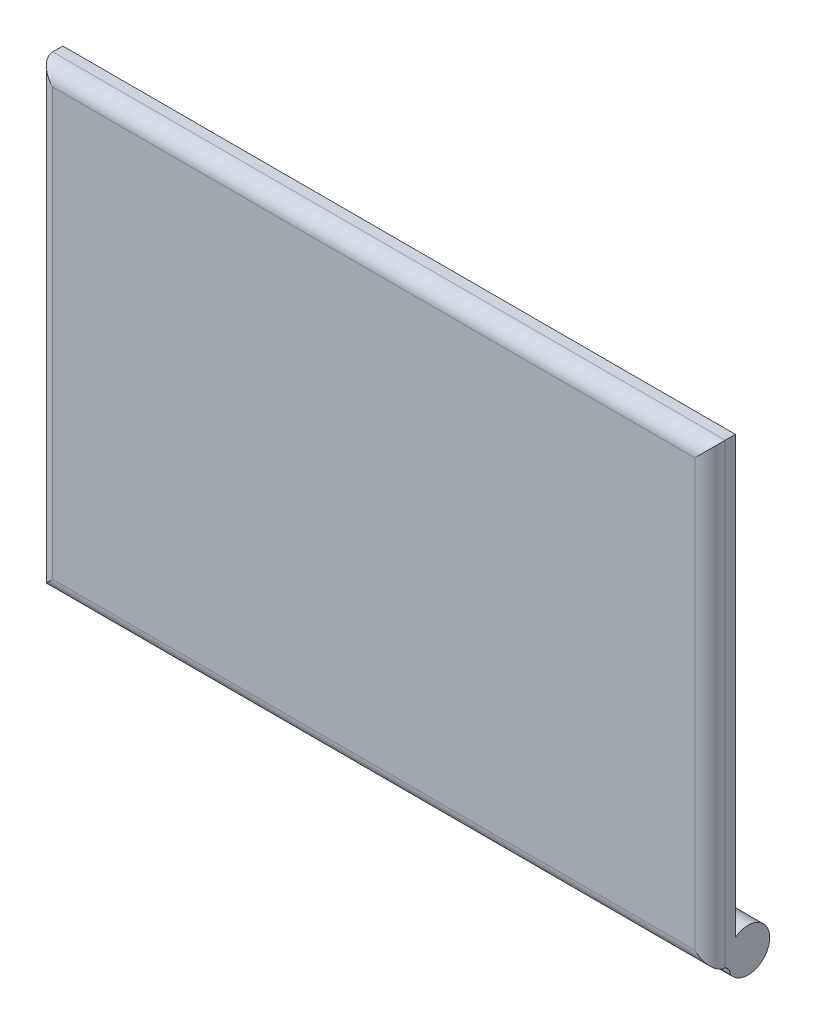
ISO-10303-21;
HEADER;
FILE_DESCRIPTION(('STEP AP214'),'2;1');
FILE_NAME('part.step','',(''),(''),'','','');
FILE_SCHEMA(('AUTOMOTIVE_DESIGN { 1 0 10303 214 1 1 1 1 }'));
ENDSEC;
DATA;
#1=APPLICATION_CONTEXT('core data for automotive mechanical design processes');
#2=APPLICATION_PROTOCOL_DEFINITION('international standard','automotive_design',2000,#1);
#3=PRODUCT_CONTEXT('',#1,'mechanical');
#4=PRODUCT('Part','Part','',(#3));
#5=PRODUCT_RELATED_PRODUCT_CATEGORY('part','',(#4));
#6=PRODUCT_DEFINITION_FORMATION('','',#4);
#7=PRODUCT_DEFINITION_CONTEXT('part definition',#1,'design');
#8=PRODUCT_DEFINITION('design','',#6,#7);
#9=PRODUCT_DEFINITION_SHAPE('','',#8);
#10=(LENGTH_UNIT() NAMED_UNIT(*) SI_UNIT(.MILLI.,.METRE.));
#11=(NAMED_UNIT(*) PLANE_ANGLE_UNIT() SI_UNIT($,.RADIAN.));
#12=(NAMED_UNIT(*) SI_UNIT($,.STERADIAN.) SOLID_ANGLE_UNIT());
#13=UNCERTAINTY_MEASURE_WITH_UNIT(LENGTH_MEASURE(1.E-05),#10,'distance_accuracy_value','');
#14=(GEOMETRIC_REPRESENTATION_CONTEXT(3) GLOBAL_UNCERTAINTY_ASSIGNED_CONTEXT((#13)) GLOBAL_UNIT_ASSIGNED_CONTEXT((#10,
#11,#12)) REPRESENTATION_CONTEXT('',''));
#15=CARTESIAN_POINT('',(0.,0.,0.));
#16=DIRECTION('',(0.,0.,1.));
#17=DIRECTION('',(1.,0.,0.));
#18=AXIS2_PLACEMENT_3D('',#15,#16,#17);
#19=CARTESIAN_POINT('',(132.5,90.,10.));
#20=DIRECTION('',(0.,0.,-1.));
#21=DIRECTION('',(-1.,0.,0.));
#22=AXIS2_PLACEMENT_3D('',#19,#20,#21);
#23=PLANE('',#22);
#24=DIRECTION('',(1.,0.,0.));
#25=VECTOR('',#24,1.);
#26=CARTESIAN_POINT('',(132.5,-84.,10.));
#27=LINE('',#26,#25);
#28=CARTESIAN_POINT('',(-126.5,-84.,10.));
#29=VERTEX_POINT('',#28);
#30=CARTESIAN_POINT('',(126.5,-84.,10.));
#31=VERTEX_POINT('',#30);
#32=EDGE_CURVE('E41',#29,#31,#27,.T.);
#33=ORIENTED_EDGE('',*,*,#32,.T.);
#34=DIRECTION('',(0.,1.,0.));
#35=VECTOR('',#34,1.);
#36=CARTESIAN_POINT('',(126.5,90.,10.));
#37=LINE('',#36,#35);
#38=CARTESIAN_POINT('',(126.5,84.,10.));
#39=VERTEX_POINT('',#38);
#40=EDGE_CURVE('E228',#31,#39,#37,.T.);
#41=ORIENTED_EDGE('',*,*,#40,.T.);
#42=DIRECTION('',(-1.,0.,0.));
#43=VECTOR('',#42,1.);
#44=CARTESIAN_POINT('',(132.5,84.,10.));
#45=LINE('',#44,#43);
#46=CARTESIAN_POINT('',(-126.5,84.,10.));
#47=VERTEX_POINT('',#46);
#48=EDGE_CURVE('E226',#39,#47,#45,.T.);
#49=ORIENTED_EDGE('',*,*,#48,.T.);
#50=DIRECTION('',(0.,-1.,0.));
#51=VECTOR('',#50,1.);
#52=CARTESIAN_POINT('',(-126.5,90.,10.));
#53=LINE('',#52,#51);
#54=EDGE_CURVE('E218',#47,#29,#53,.T.);
#55=ORIENTED_EDGE('',*,*,#54,.T.);
#56=EDGE_LOOP('',(#33,#41,#49,#55));
#57=FACE_BOUND('',#56,.T.);
#58=ADVANCED_FACE('F33',(#57),#23,.F.);
#59=CARTESIAN_POINT('',(-132.5,-90.,10.));
#60=DIRECTION('',(0.,1.,0.));
#61=DIRECTION('',(0.,0.,1.));
#62=AXIS2_PLACEMENT_3D('',#59,#60,#61);
#63=PLANE('',#62);
#64=DIRECTION('',(0.,0.,1.));
#65=VECTOR('',#64,1.);
#66=CARTESIAN_POINT('',(115.5,-90.,4.3855365799078));
#67=LINE('',#66,#65);
#68=CARTESIAN_POINT('',(115.5,-90.,0.));
#69=VERTEX_POINT('',#68);
#70=CARTESIAN_POINT('',(115.5,-90.,4.));
#71=VERTEX_POINT('',#70);
#72=EDGE_CURVE('E124',#69,#71,#67,.T.);
#73=ORIENTED_EDGE('',*,*,#72,.T.);
#74=DIRECTION('',(1.,0.,0.));
#75=VECTOR('',#74,1.);
#76=CARTESIAN_POINT('',(-132.5,-90.,4.));
#77=LINE('',#76,#75);
#78=CARTESIAN_POINT('',(-115.5,-90.,4.));
#79=VERTEX_POINT('',#78);
#80=EDGE_CURVE('E11',#71,#79,#77,.F.);
#81=ORIENTED_EDGE('',*,*,#80,.T.);
#82=DIRECTION('',(0.,0.,1.));
#83=VECTOR('',#82,1.);
#84=CARTESIAN_POINT('',(-115.5,-90.,4.3855365799078));
#85=LINE('',#84,#83);
#86=CARTESIAN_POINT('',(-115.5,-90.,0.));
#87=VERTEX_POINT('',#86);
#88=EDGE_CURVE('E195',#87,#79,#85,.T.);
#89=ORIENTED_EDGE('',*,*,#88,.F.);
#90=DIRECTION('',(1.,0.,0.));
#91=VECTOR('',#90,1.);
#92=CARTESIAN_POINT('',(-132.5,-90.,0.));
#93=LINE('',#92,#91);
#94=EDGE_CURVE('E128',#87,#69,#93,.T.);
#95=ORIENTED_EDGE('',*,*,#94,.T.);
#96=EDGE_LOOP('',(#73,#81,#89,#95));
#97=FACE_BOUND('',#96,.T.);
#98=ADVANCED_FACE('F126',(#97),#63,.F.);
#99=CARTESIAN_POINT('',(132.5,90.,0.));
#100=DIRECTION('',(0.,0.,-1.));
#101=DIRECTION('',(-1.,0.,0.));
#102=AXIS2_PLACEMENT_3D('',#99,#100,#101);
#103=PLANE('',#102);
#104=DIRECTION('',(0.,1.,0.));
#105=VECTOR('',#104,1.);
#106=CARTESIAN_POINT('',(132.5,-90.,0.));
#107=LINE('',#106,#105);
#108=CARTESIAN_POINT('',(132.5,-81.6261364575663,0.));
#109=VERTEX_POINT('',#108);
#110=CARTESIAN_POINT('',(132.5,90.,0.));
#111=VERTEX_POINT('',#110);
#112=EDGE_CURVE('E202',#109,#111,#107,.T.);
#113=ORIENTED_EDGE('',*,*,#112,.F.);
#114=DIRECTION('',(1.,0.,0.));
#115=VECTOR('',#114,1.);
#116=CARTESIAN_POINT('',(115.5,-81.6261364575663,0.));
#117=LINE('',#116,#115);
#118=CARTESIAN_POINT('',(115.5,-81.6261364575663,0.));
#119=VERTEX_POINT('',#118);
#120=EDGE_CURVE('E187',#119,#109,#117,.T.);
#121=ORIENTED_EDGE('',*,*,#120,.F.);
#122=DIRECTION('',(0.,-1.,0.));
#123=VECTOR('',#122,1.);
#124=CARTESIAN_POINT('',(115.5,-154.315837182719,0.));
#125=LINE('',#124,#123);
#126=EDGE_CURVE('E181',#119,#69,#125,.T.);
#127=ORIENTED_EDGE('',*,*,#126,.T.);
#128=ORIENTED_EDGE('',*,*,#94,.F.);
#129=DIRECTION('',(0.,-1.,0.));
#130=VECTOR('',#129,1.);
#131=CARTESIAN_POINT('',(-115.5,-154.315837182719,0.));
#132=LINE('',#131,#130);
#133=CARTESIAN_POINT('',(-115.5,-81.6261364575663,0.));
#134=VERTEX_POINT('',#133);
#135=EDGE_CURVE('E192',#134,#87,#132,.T.);
#136=ORIENTED_EDGE('',*,*,#135,.F.);
#137=DIRECTION('',(-1.,0.,0.));
#138=VECTOR('',#137,1.);
#139=CARTESIAN_POINT('',(-115.5,-81.6261364575663,0.));
#140=LINE('',#139,#138);
#141=CARTESIAN_POINT('',(-132.5,-81.6261364575663,0.));
#142=VERTEX_POINT('',#141);
#143=EDGE_CURVE('E198',#134,#142,#140,.T.);
#144=ORIENTED_EDGE('',*,*,#143,.T.);
#145=DIRECTION('',(0.,-1.,0.));
#146=VECTOR('',#145,1.);
#147=CARTESIAN_POINT('',(-132.5,-90.,0.));
#148=LINE('',#147,#146);
#149=CARTESIAN_POINT('',(-132.5,90.,0.));
#150=VERTEX_POINT('',#149);
#151=EDGE_CURVE('E210',#150,#142,#148,.T.);
#152=ORIENTED_EDGE('',*,*,#151,.F.);
#153=DIRECTION('',(-1.,0.,0.));
#154=VECTOR('',#153,1.);
#155=CARTESIAN_POINT('',(-132.5,90.,0.));
#156=LINE('',#155,#154);
#157=EDGE_CURVE('E207',#111,#150,#156,.T.);
#158=ORIENTED_EDGE('',*,*,#157,.F.);
#159=EDGE_LOOP('',(#113,#121,#127,#128,#136,#144,#152,#158));
#160=FACE_BOUND('',#159,.T.);
#161=ADVANCED_FACE('F267',(#160),#103,.T.);
#162=CARTESIAN_POINT('',(132.5,-90.,10.));
#163=DIRECTION('',(-1.,0.,0.));
#164=DIRECTION('',(0.,0.,1.));
#165=AXIS2_PLACEMENT_3D('',#162,#163,#164);
#166=PLANE('',#165);
#167=DIRECTION('',(0.,1.,0.));
#168=VECTOR('',#167,1.);
#169=CARTESIAN_POINT('',(132.5,-90.,4.));
#170=LINE('',#169,#168);
#171=CARTESIAN_POINT('',(132.5,90.,4.));
#172=VERTEX_POINT('',#171);
#173=CARTESIAN_POINT('',(132.5,-90.,4.));
#174=VERTEX_POINT('',#173);
#175=EDGE_CURVE('E230',#172,#174,#170,.F.);
#176=ORIENTED_EDGE('',*,*,#175,.T.);
#177=CARTESIAN_POINT('',(132.5,-93.4083123918128,1.93963035502445));
#178=CARTESIAN_POINT('',(132.5,-91.034387849388,2.16160375103339));
#179=CARTESIAN_POINT('',(132.5,-90.,4.));
#180=B_SPLINE_CURVE_WITH_KNOTS('',2,(#177,#178,#179),.UNSPECIFIED.,.F.,.F.,(3,3),(0.,1.),.UNSPECIFIED.);
#181=CARTESIAN_POINT('',(132.5,-93.4083123918128,1.93963035502445));
#182=VERTEX_POINT('',#181);
#183=EDGE_CURVE('E145',#174,#182,#180,.F.);
#184=ORIENTED_EDGE('',*,*,#183,.T.);
#185=CARTESIAN_POINT('',(132.5,-88.5,-5.));
#186=DIRECTION('',(-1.,0.,0.));
#187=DIRECTION('',(0.,0.,1.));
#188=AXIS2_PLACEMENT_3D('',#185,#186,#187);
#189=CIRCLE('',#188,8.5);
#190=EDGE_CURVE('E133',#109,#182,#189,.T.);
#191=ORIENTED_EDGE('',*,*,#190,.F.);
#192=ORIENTED_EDGE('',*,*,#112,.T.);
#193=DIRECTION('',(0.,0.,-1.));
#194=VECTOR('',#193,1.);
#195=CARTESIAN_POINT('',(132.5,90.,10.));
#196=LINE('',#195,#194);
#197=EDGE_CURVE('E216',#172,#111,#196,.T.);
#198=ORIENTED_EDGE('',*,*,#197,.F.);
#199=EDGE_LOOP('',(#176,#184,#191,#192,#198));
#200=FACE_BOUND('',#199,.T.);
#201=ADVANCED_FACE('F276',(#200),#166,.F.);
#202=CARTESIAN_POINT('',(-132.5,90.,10.));
#203=DIRECTION('',(0.,-1.,0.));
#204=DIRECTION('',(0.,0.,-1.));
#205=AXIS2_PLACEMENT_3D('',#202,#203,#204);
#206=PLANE('',#205);
#207=DIRECTION('',(0.,0.,-1.));
#208=VECTOR('',#207,1.);
#209=CARTESIAN_POINT('',(-132.5,90.,10.));
#210=LINE('',#209,#208);
#211=CARTESIAN_POINT('',(-132.5,90.,4.));
#212=VERTEX_POINT('',#211);
#213=EDGE_CURVE('E214',#212,#150,#210,.T.);
#214=ORIENTED_EDGE('',*,*,#213,.F.);
#215=DIRECTION('',(-1.,0.,0.));
#216=VECTOR('',#215,1.);
#217=CARTESIAN_POINT('',(-132.5,90.,4.));
#218=LINE('',#217,#216);
#219=EDGE_CURVE('E233',#212,#172,#218,.F.);
#220=ORIENTED_EDGE('',*,*,#219,.T.);
#221=ORIENTED_EDGE('',*,*,#197,.T.);
#222=ORIENTED_EDGE('',*,*,#157,.T.);
#223=EDGE_LOOP('',(#214,#220,#221,#222));
#224=FACE_BOUND('',#223,.T.);
#225=ADVANCED_FACE('F272',(#224),#206,.F.);
#226=CARTESIAN_POINT('',(-132.5,-90.,10.));
#227=DIRECTION('',(1.,0.,0.));
#228=DIRECTION('',(0.,0.,-1.));
#229=AXIS2_PLACEMENT_3D('',#226,#227,#228);
#230=PLANE('',#229);
#231=CARTESIAN_POINT('',(-132.5,-88.5,-5.));
#232=DIRECTION('',(-1.,0.,0.));
#233=DIRECTION('',(0.,0.,1.));
#234=AXIS2_PLACEMENT_3D('',#231,#232,#233);
#235=CIRCLE('',#234,8.5);
#236=CARTESIAN_POINT('',(-132.5,-93.4083123918128,1.93963035502445));
#237=VERTEX_POINT('',#236);
#238=EDGE_CURVE('E190',#142,#237,#235,.T.);
#239=ORIENTED_EDGE('',*,*,#238,.T.);
#240=CARTESIAN_POINT('',(-132.5,-93.4083123918128,1.93963035502445));
#241=CARTESIAN_POINT('',(-132.5,-91.034387849388,2.16160375103339));
#242=CARTESIAN_POINT('',(-132.5,-90.,4.));
#243=B_SPLINE_CURVE_WITH_KNOTS('',2,(#240,#241,#242),.UNSPECIFIED.,.F.,.F.,(3,3),(0.,1.),.UNSPECIFIED.);
#244=CARTESIAN_POINT('',(-132.5,-90.,4.));
#245=VERTEX_POINT('',#244);
#246=EDGE_CURVE('E48',#237,#245,#243,.T.);
#247=ORIENTED_EDGE('',*,*,#246,.T.);
#248=DIRECTION('',(0.,-1.,0.));
#249=VECTOR('',#248,1.);
#250=CARTESIAN_POINT('',(-132.5,-90.,4.));
#251=LINE('',#250,#249);
#252=EDGE_CURVE('E235',#245,#212,#251,.F.);
#253=ORIENTED_EDGE('',*,*,#252,.T.);
#254=ORIENTED_EDGE('',*,*,#213,.T.);
#255=ORIENTED_EDGE('',*,*,#151,.T.);
#256=EDGE_LOOP('',(#239,#247,#253,#254,#255));
#257=FACE_BOUND('',#256,.T.);
#258=ADVANCED_FACE('F269',(#257),#230,.F.);
#259=CARTESIAN_POINT('',(-115.5,-88.5,-5.));
#260=DIRECTION('',(-1.,0.,0.));
#261=DIRECTION('',(0.,0.,1.));
#262=AXIS2_PLACEMENT_3D('',#259,#260,#261);
#263=CYLINDRICAL_SURFACE('',#262,8.5);
#264=ORIENTED_EDGE('',*,*,#238,.F.);
#265=ORIENTED_EDGE('',*,*,#143,.F.);
#266=CARTESIAN_POINT('',(-115.5,-88.5,-5.));
#267=DIRECTION('',(-1.,0.,0.));
#268=DIRECTION('',(0.,0.,1.));
#269=AXIS2_PLACEMENT_3D('',#266,#267,#268);
#270=CIRCLE('',#269,8.5);
#271=CARTESIAN_POINT('',(-115.5,-93.4083123918128,1.93963035502445));
#272=VERTEX_POINT('',#271);
#273=EDGE_CURVE('E194',#134,#272,#270,.T.);
#274=ORIENTED_EDGE('',*,*,#273,.T.);
#275=DIRECTION('',(-1.,0.,0.));
#276=VECTOR('',#275,1.);
#277=CARTESIAN_POINT('',(-115.5,-93.4083123918128,1.93963035502445));
#278=LINE('',#277,#276);
#279=EDGE_CURVE('E200',#272,#237,#278,.T.);
#280=ORIENTED_EDGE('',*,*,#279,.T.);
#281=EDGE_LOOP('',(#264,#265,#274,#280));
#282=FACE_BOUND('',#281,.T.);
#283=ADVANCED_FACE('F263',(#282),#263,.T.);
#284=CARTESIAN_POINT('',(-115.5,-154.315837182719,4.3855365799078));
#285=DIRECTION('',(-1.,0.,0.));
#286=DIRECTION('',(0.,0.,1.));
#287=AXIS2_PLACEMENT_3D('',#284,#285,#286);
#288=PLANE('',#287);
#289=ORIENTED_EDGE('',*,*,#88,.T.);
#290=CARTESIAN_POINT('',(-115.5,-93.4083123918128,1.93963035502445));
#291=CARTESIAN_POINT('',(-115.5,-91.034387849388,2.16160375103339));
#292=CARTESIAN_POINT('',(-115.5,-90.,4.));
#293=B_SPLINE_CURVE_WITH_KNOTS('',2,(#290,#291,#292),.UNSPECIFIED.,.F.,.F.,(3,3),(0.,1.),.UNSPECIFIED.);
#294=EDGE_CURVE('E141',#79,#272,#293,.F.);
#295=ORIENTED_EDGE('',*,*,#294,.T.);
#296=ORIENTED_EDGE('',*,*,#273,.F.);
#297=ORIENTED_EDGE('',*,*,#135,.T.);
#298=EDGE_LOOP('',(#289,#295,#296,#297));
#299=FACE_BOUND('',#298,.T.);
#300=ADVANCED_FACE('F260',(#299),#288,.F.);
#301=CARTESIAN_POINT('',(115.5,-88.5,-5.));
#302=DIRECTION('',(1.,0.,0.));
#303=DIRECTION('',(0.,0.,-1.));
#304=AXIS2_PLACEMENT_3D('',#301,#302,#303);
#305=CYLINDRICAL_SURFACE('',#304,8.5);
#306=ORIENTED_EDGE('',*,*,#190,.T.);
#307=DIRECTION('',(1.,0.,0.));
#308=VECTOR('',#307,1.);
#309=CARTESIAN_POINT('',(115.5,-93.4083123918128,1.93963035502445));
#310=LINE('',#309,#308);
#311=CARTESIAN_POINT('',(115.5,-93.4083123918128,1.93963035502445));
#312=VERTEX_POINT('',#311);
#313=EDGE_CURVE('E183',#312,#182,#310,.T.);
#314=ORIENTED_EDGE('',*,*,#313,.F.);
#315=CARTESIAN_POINT('',(115.5,-88.5,-5.));
#316=DIRECTION('',(-1.,0.,0.));
#317=DIRECTION('',(0.,0.,1.));
#318=AXIS2_PLACEMENT_3D('',#315,#316,#317);
#319=CIRCLE('',#318,8.5);
#320=EDGE_CURVE('E132',#119,#312,#319,.T.);
#321=ORIENTED_EDGE('',*,*,#320,.F.);
#322=ORIENTED_EDGE('',*,*,#120,.T.);
#323=EDGE_LOOP('',(#306,#314,#321,#322));
#324=FACE_BOUND('',#323,.T.);
#325=ADVANCED_FACE('F278',(#324),#305,.T.);
#326=CARTESIAN_POINT('',(115.5,-154.315837182719,4.3855365799078));
#327=DIRECTION('',(1.,0.,0.));
#328=DIRECTION('',(0.,0.,1.));
#329=AXIS2_PLACEMENT_3D('',#326,#327,#328);
#330=PLANE('',#329);
#331=ORIENTED_EDGE('',*,*,#320,.T.);
#332=CARTESIAN_POINT('',(115.5,-93.4083123918128,1.93963035502445));
#333=CARTESIAN_POINT('',(115.5,-91.034387849388,2.16160375103339));
#334=CARTESIAN_POINT('',(115.5,-90.,4.));
#335=B_SPLINE_CURVE_WITH_KNOTS('',2,(#332,#333,#334),.UNSPECIFIED.,.F.,.F.,(3,3),(0.,1.),.UNSPECIFIED.);
#336=EDGE_CURVE('E136',#312,#71,#335,.T.);
#337=ORIENTED_EDGE('',*,*,#336,.T.);
#338=ORIENTED_EDGE('',*,*,#72,.F.);
#339=ORIENTED_EDGE('',*,*,#126,.F.);
#340=EDGE_LOOP('',(#331,#337,#338,#339));
#341=FACE_BOUND('',#340,.T.);
#342=ADVANCED_FACE('F137',(#341),#330,.F.);
#343=CARTESIAN_POINT('',(-126.5,90.,4.));
#344=DIRECTION('',(0.,-1.,0.));
#345=DIRECTION('',(0.,0.,-1.));
#346=AXIS2_PLACEMENT_3D('',#343,#344,#345);
#347=CYLINDRICAL_SURFACE('',#346,6.);
#348=CARTESIAN_POINT('',(-126.5,-84.,4.));
#349=DIRECTION('',(0.707106781186547,-0.707106781186547,0.));
#350=DIRECTION('',(-0.707106781186547,-0.707106781186547,0.));
#351=AXIS2_PLACEMENT_3D('',#348,#349,#350);
#352=ELLIPSE('',#351,8.48528137423857,6.);
#353=EDGE_CURVE('E177',#29,#245,#352,.T.);
#354=ORIENTED_EDGE('',*,*,#353,.F.);
#355=ORIENTED_EDGE('',*,*,#54,.F.);
#356=CARTESIAN_POINT('',(-126.5,84.,4.));
#357=DIRECTION('',(-0.707106781186547,-0.707106781186547,0.));
#358=DIRECTION('',(0.707106781186547,-0.707106781186547,0.));
#359=AXIS2_PLACEMENT_3D('',#356,#357,#358);
#360=ELLIPSE('',#359,8.48528137423857,6.);
#361=EDGE_CURVE('E186',#212,#47,#360,.F.);
#362=ORIENTED_EDGE('',*,*,#361,.F.);
#363=ORIENTED_EDGE('',*,*,#252,.F.);
#364=EDGE_LOOP('',(#354,#355,#362,#363));
#365=FACE_BOUND('',#364,.T.);
#366=ADVANCED_FACE('F253',(#365),#347,.T.);
#367=CARTESIAN_POINT('',(132.5,84.,4.));
#368=DIRECTION('',(-1.,0.,0.));
#369=DIRECTION('',(0.,0.,1.));
#370=AXIS2_PLACEMENT_3D('',#367,#368,#369);
#371=CYLINDRICAL_SURFACE('',#370,6.);
#372=ORIENTED_EDGE('',*,*,#361,.T.);
#373=ORIENTED_EDGE('',*,*,#48,.F.);
#374=CARTESIAN_POINT('',(126.5,84.,4.));
#375=DIRECTION('',(-0.707106781186547,0.707106781186547,0.));
#376=DIRECTION('',(-0.707106781186547,-0.707106781186547,0.));
#377=AXIS2_PLACEMENT_3D('',#374,#375,#376);
#378=ELLIPSE('',#377,8.48528137423857,6.);
#379=EDGE_CURVE('E179',#172,#39,#378,.F.);
#380=ORIENTED_EDGE('',*,*,#379,.F.);
#381=ORIENTED_EDGE('',*,*,#219,.F.);
#382=EDGE_LOOP('',(#372,#373,#380,#381));
#383=FACE_BOUND('',#382,.T.);
#384=ADVANCED_FACE('F250',(#383),#371,.T.);
#385=CARTESIAN_POINT('',(126.5,90.,4.));
#386=DIRECTION('',(0.,1.,0.));
#387=DIRECTION('',(0.,0.,1.));
#388=AXIS2_PLACEMENT_3D('',#385,#386,#387);
#389=CYLINDRICAL_SURFACE('',#388,6.);
#390=CARTESIAN_POINT('',(126.5,-84.,4.));
#391=DIRECTION('',(0.707106781186547,0.707106781186547,0.));
#392=DIRECTION('',(-0.707106781186547,0.707106781186547,0.));
#393=AXIS2_PLACEMENT_3D('',#390,#391,#392);
#394=ELLIPSE('',#393,8.48528137423857,6.);
#395=EDGE_CURVE('E172',#174,#31,#394,.F.);
#396=ORIENTED_EDGE('',*,*,#395,.F.);
#397=ORIENTED_EDGE('',*,*,#175,.F.);
#398=ORIENTED_EDGE('',*,*,#379,.T.);
#399=ORIENTED_EDGE('',*,*,#40,.F.);
#400=EDGE_LOOP('',(#396,#397,#398,#399));
#401=FACE_BOUND('',#400,.T.);
#402=ADVANCED_FACE('F244',(#401),#389,.T.);
#403=CARTESIAN_POINT('',(132.5,-84.,4.));
#404=DIRECTION('',(1.,0.,0.));
#405=DIRECTION('',(0.,0.,-1.));
#406=AXIS2_PLACEMENT_3D('',#403,#404,#405);
#407=CYLINDRICAL_SURFACE('',#406,6.);
#408=ORIENTED_EDGE('',*,*,#32,.F.);
#409=ORIENTED_EDGE('',*,*,#353,.T.);
#410=DIRECTION('',(1.,0.,0.));
#411=VECTOR('',#410,1.);
#412=CARTESIAN_POINT('',(-848.983151365638,-90.,4.));
#413=LINE('',#412,#411);
#414=EDGE_CURVE('E119',#245,#79,#413,.T.);
#415=ORIENTED_EDGE('',*,*,#414,.T.);
#416=ORIENTED_EDGE('',*,*,#80,.F.);
#417=EDGE_CURVE('E117',#71,#174,#413,.T.);
#418=ORIENTED_EDGE('',*,*,#417,.T.);
#419=ORIENTED_EDGE('',*,*,#395,.T.);
#420=EDGE_LOOP('',(#408,#409,#415,#416,#418,#419));
#421=FACE_BOUND('',#420,.T.);
#422=ADVANCED_FACE('F35',(#421),#407,.T.);
#423=CARTESIAN_POINT('',(-848.983151365638,-93.4083123918128,1.93963035502445));
#424=CARTESIAN_POINT('',(-848.983151365638,-91.034387849388,2.16160375103339));
#425=CARTESIAN_POINT('',(-848.983151365638,-90.,4.));
#426=B_SPLINE_CURVE_WITH_KNOTS('',2,(#423,#424,#425),.UNSPECIFIED.,.F.,.F.,(3,3),(0.,1.),.UNSPECIFIED.);
#427=DIRECTION('',(1.,0.,0.));
#428=VECTOR('',#427,1.);
#429=SURFACE_OF_LINEAR_EXTRUSION('',#426,#428);
#430=ORIENTED_EDGE('',*,*,#183,.F.);
#431=ORIENTED_EDGE('',*,*,#417,.F.);
#432=ORIENTED_EDGE('',*,*,#336,.F.);
#433=ORIENTED_EDGE('',*,*,#313,.T.);
#434=EDGE_LOOP('',(#430,#431,#432,#433));
#435=FACE_BOUND('',#434,.T.);
#436=ADVANCED_FACE('F144',(#435),#429,.F.);
#437=ORIENTED_EDGE('',*,*,#246,.F.);
#438=ORIENTED_EDGE('',*,*,#279,.F.);
#439=ORIENTED_EDGE('',*,*,#294,.F.);
#440=ORIENTED_EDGE('',*,*,#414,.F.);
#441=EDGE_LOOP('',(#437,#438,#439,#440));
#442=FACE_BOUND('',#441,.T.);
#443=ADVANCED_FACE('F256',(#442),#429,.F.);
#444=CLOSED_SHELL('',(#58,#98,#161,#201,#225,#258,#283,#300,#325,#342,#366,#384,#402,#422,#436,#443));
#445=MANIFOLD_SOLID_BREP('B2',#444);
#446=ADVANCED_BREP_SHAPE_REPRESENTATION('',(#18,#445),#14);
#447=SHAPE_DEFINITION_REPRESENTATION(#9,#446);
ENDSEC;
END-ISO-10303-21;
